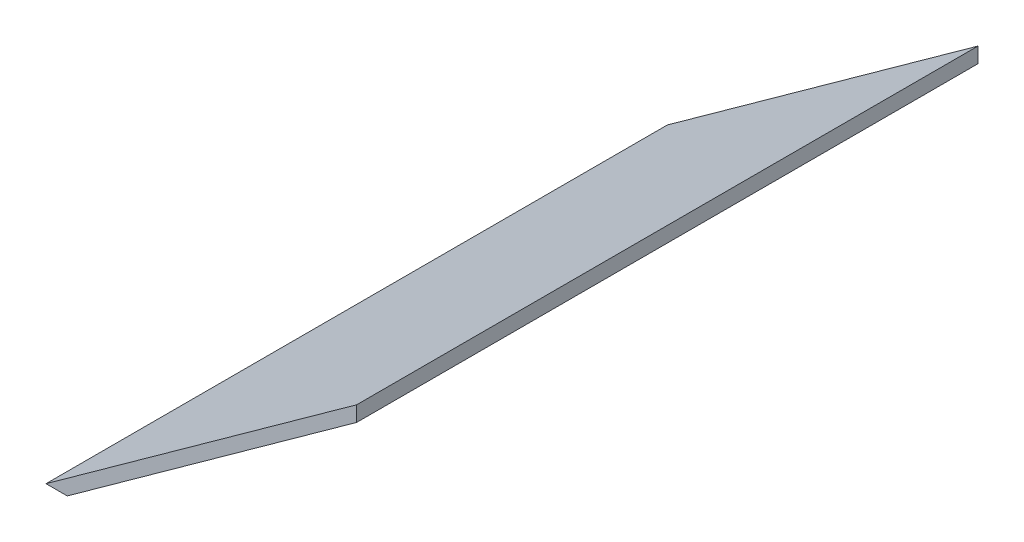
ISO-10303-21;
HEADER;
FILE_DESCRIPTION(('STEP AP214'),'2;1');
FILE_NAME('part.step','',(''),(''),'','','');
FILE_SCHEMA(('AUTOMOTIVE_DESIGN { 1 0 10303 214 1 1 1 1 }'));
ENDSEC;
DATA;
#1=APPLICATION_CONTEXT('core data for automotive mechanical design processes');
#2=APPLICATION_PROTOCOL_DEFINITION('international standard','automotive_design',2000,#1);
#3=PRODUCT_CONTEXT('',#1,'mechanical');
#4=PRODUCT('Part','Part','',(#3));
#5=PRODUCT_RELATED_PRODUCT_CATEGORY('part','',(#4));
#6=PRODUCT_DEFINITION_FORMATION('','',#4);
#7=PRODUCT_DEFINITION_CONTEXT('part definition',#1,'design');
#8=PRODUCT_DEFINITION('design','',#6,#7);
#9=PRODUCT_DEFINITION_SHAPE('','',#8);
#10=(LENGTH_UNIT() NAMED_UNIT(*) SI_UNIT(.MILLI.,.METRE.));
#11=(NAMED_UNIT(*) PLANE_ANGLE_UNIT() SI_UNIT($,.RADIAN.));
#12=(NAMED_UNIT(*) SI_UNIT($,.STERADIAN.) SOLID_ANGLE_UNIT());
#13=UNCERTAINTY_MEASURE_WITH_UNIT(LENGTH_MEASURE(1.E-05),#10,'distance_accuracy_value','');
#14=(GEOMETRIC_REPRESENTATION_CONTEXT(3) GLOBAL_UNCERTAINTY_ASSIGNED_CONTEXT((#13)) GLOBAL_UNIT_ASSIGNED_CONTEXT((#10,
#11,#12)) REPRESENTATION_CONTEXT('',''));
#15=CARTESIAN_POINT('',(0.,0.,0.));
#16=DIRECTION('',(0.,0.,1.));
#17=DIRECTION('',(1.,0.,0.));
#18=AXIS2_PLACEMENT_3D('',#15,#16,#17);
#19=CARTESIAN_POINT('',(-107.885642443612,0.,500.));
#20=DIRECTION('',(0.,1.,0.));
#21=DIRECTION('',(0.,0.,1.));
#22=AXIS2_PLACEMENT_3D('',#19,#20,#21);
#23=PLANE('',#22);
#24=DIRECTION('',(1.,0.,0.));
#25=VECTOR('',#24,1.);
#26=CARTESIAN_POINT('',(-107.885642443612,0.,0.));
#27=LINE('',#26,#25);
#28=CARTESIAN_POINT('',(-125.,0.,0.));
#29=VERTEX_POINT('',#28);
#30=CARTESIAN_POINT('',(-107.885642443612,0.,0.));
#31=VERTEX_POINT('',#30);
#32=EDGE_CURVE('E97',#29,#31,#27,.T.);
#33=ORIENTED_EDGE('',*,*,#32,.T.);
#34=DIRECTION('',(0.,0.,-1.));
#35=VECTOR('',#34,1.);
#36=CARTESIAN_POINT('',(-107.885642443612,0.,500.));
#37=LINE('',#36,#35);
#38=CARTESIAN_POINT('',(-107.885642443612,0.,500.));
#39=VERTEX_POINT('',#38);
#40=EDGE_CURVE('E11',#39,#31,#37,.T.);
#41=ORIENTED_EDGE('',*,*,#40,.F.);
#42=DIRECTION('',(1.,0.,0.));
#43=VECTOR('',#42,1.);
#44=CARTESIAN_POINT('',(-107.885642443612,0.,500.));
#45=LINE('',#44,#43);
#46=CARTESIAN_POINT('',(-125.,0.,500.));
#47=VERTEX_POINT('',#46);
#48=EDGE_CURVE('E85',#47,#39,#45,.T.);
#49=ORIENTED_EDGE('',*,*,#48,.F.);
#50=DIRECTION('',(0.,0.,-1.));
#51=VECTOR('',#50,1.);
#52=CARTESIAN_POINT('',(-125.,0.,500.));
#53=LINE('',#52,#51);
#54=EDGE_CURVE('E93',#47,#29,#53,.T.);
#55=ORIENTED_EDGE('',*,*,#54,.T.);
#56=EDGE_LOOP('',(#33,#41,#49,#55));
#57=FACE_BOUND('',#56,.T.);
#58=ADVANCED_FACE('F34',(#57),#23,.F.);
#59=CARTESIAN_POINT('',(5.84304725845077,81.884656585485,500.));
#60=DIRECTION('',(-0.584304725845076,0.811534341451495,0.));
#61=DIRECTION('',(-0.811534341451494,-0.584304725845076,0.));
#62=AXIS2_PLACEMENT_3D('',#59,#60,#61);
#63=PLANE('',#62);
#64=DIRECTION('',(0.811534341451494,0.584304725845076,0.));
#65=VECTOR('',#64,1.);
#66=CARTESIAN_POINT('',(5.84304725845077,81.884656585485,0.));
#67=LINE('',#66,#65);
#68=CARTESIAN_POINT('',(125.,167.6776625594,0.));
#69=VERTEX_POINT('',#68);
#70=EDGE_CURVE('E89',#31,#69,#67,.T.);
#71=ORIENTED_EDGE('',*,*,#70,.T.);
#72=DIRECTION('',(0.,0.,-1.));
#73=VECTOR('',#72,1.);
#74=CARTESIAN_POINT('',(125.,167.6776625594,500.));
#75=LINE('',#74,#73);
#76=CARTESIAN_POINT('',(125.,167.6776625594,500.));
#77=VERTEX_POINT('',#76);
#78=EDGE_CURVE('E42',#77,#69,#75,.T.);
#79=ORIENTED_EDGE('',*,*,#78,.F.);
#80=DIRECTION('',(0.811534341451495,0.584304725845076,0.));
#81=VECTOR('',#80,1.);
#82=CARTESIAN_POINT('',(5.84304725845077,81.884656585485,500.));
#83=LINE('',#82,#81);
#84=EDGE_CURVE('E80',#39,#77,#83,.T.);
#85=ORIENTED_EDGE('',*,*,#84,.F.);
#86=ORIENTED_EDGE('',*,*,#40,.T.);
#87=EDGE_LOOP('',(#71,#79,#85,#86));
#88=FACE_BOUND('',#87,.T.);
#89=ADVANCED_FACE('F88',(#88),#63,.F.);
#90=CARTESIAN_POINT('',(125.,167.6776625594,500.));
#91=DIRECTION('',(-1.,0.,0.));
#92=DIRECTION('',(0.,0.,1.));
#93=AXIS2_PLACEMENT_3D('',#90,#91,#92);
#94=PLANE('',#93);
#95=DIRECTION('',(0.,1.,0.));
#96=VECTOR('',#95,1.);
#97=CARTESIAN_POINT('',(125.,167.6776625594,0.));
#98=LINE('',#97,#96);
#99=CARTESIAN_POINT('',(125.,180.,0.));
#100=VERTEX_POINT('',#99);
#101=EDGE_CURVE('E67',#69,#100,#98,.T.);
#102=ORIENTED_EDGE('',*,*,#101,.T.);
#103=DIRECTION('',(0.,0.,-1.));
#104=VECTOR('',#103,1.);
#105=CARTESIAN_POINT('',(125.,180.,500.));
#106=LINE('',#105,#104);
#107=CARTESIAN_POINT('',(125.,180.,500.));
#108=VERTEX_POINT('',#107);
#109=EDGE_CURVE('E90',#108,#100,#106,.T.);
#110=ORIENTED_EDGE('',*,*,#109,.F.);
#111=DIRECTION('',(0.,1.,0.));
#112=VECTOR('',#111,1.);
#113=CARTESIAN_POINT('',(125.,167.6776625594,500.));
#114=LINE('',#113,#112);
#115=EDGE_CURVE('E83',#77,#108,#114,.T.);
#116=ORIENTED_EDGE('',*,*,#115,.F.);
#117=ORIENTED_EDGE('',*,*,#78,.T.);
#118=EDGE_LOOP('',(#102,#110,#116,#117));
#119=FACE_BOUND('',#118,.T.);
#120=ADVANCED_FACE('F91',(#119),#94,.F.);
#121=CARTESIAN_POINT('',(-125.,0.,500.));
#122=DIRECTION('',(0.584304725845076,-0.811534341451494,0.));
#123=DIRECTION('',(0.811534341451494,0.584304725845076,0.));
#124=AXIS2_PLACEMENT_3D('',#121,#122,#123);
#125=PLANE('',#124);
#126=DIRECTION('',(-0.811534341451494,-0.584304725845076,0.));
#127=VECTOR('',#126,1.);
#128=CARTESIAN_POINT('',(-125.,0.,0.));
#129=LINE('',#128,#127);
#130=EDGE_CURVE('E73',#100,#29,#129,.T.);
#131=ORIENTED_EDGE('',*,*,#130,.T.);
#132=ORIENTED_EDGE('',*,*,#54,.F.);
#133=DIRECTION('',(-0.811534341451494,-0.584304725845076,0.));
#134=VECTOR('',#133,1.);
#135=CARTESIAN_POINT('',(-125.,0.,500.));
#136=LINE('',#135,#134);
#137=EDGE_CURVE('E50',#108,#47,#136,.T.);
#138=ORIENTED_EDGE('',*,*,#137,.F.);
#139=ORIENTED_EDGE('',*,*,#109,.T.);
#140=EDGE_LOOP('',(#131,#132,#138,#139));
#141=FACE_BOUND('',#140,.T.);
#142=ADVANCED_FACE('F104',(#141),#125,.F.);
#143=CARTESIAN_POINT('',(0.,0.,500.));
#144=DIRECTION('',(0.,0.,-1.));
#145=DIRECTION('',(-1.,0.,0.));
#146=AXIS2_PLACEMENT_3D('',#143,#144,#145);
#147=PLANE('',#146);
#148=ORIENTED_EDGE('',*,*,#48,.T.);
#149=ORIENTED_EDGE('',*,*,#84,.T.);
#150=ORIENTED_EDGE('',*,*,#115,.T.);
#151=ORIENTED_EDGE('',*,*,#137,.T.);
#152=EDGE_LOOP('',(#148,#149,#150,#151));
#153=FACE_BOUND('',#152,.T.);
#154=ADVANCED_FACE('F81',(#153),#147,.F.);
#155=CARTESIAN_POINT('',(0.,0.,0.));
#156=DIRECTION('',(0.,0.,-1.));
#157=DIRECTION('',(-1.,0.,0.));
#158=AXIS2_PLACEMENT_3D('',#155,#156,#157);
#159=PLANE('',#158);
#160=ORIENTED_EDGE('',*,*,#32,.F.);
#161=ORIENTED_EDGE('',*,*,#130,.F.);
#162=ORIENTED_EDGE('',*,*,#101,.F.);
#163=ORIENTED_EDGE('',*,*,#70,.F.);
#164=EDGE_LOOP('',(#160,#161,#162,#163));
#165=FACE_BOUND('',#164,.T.);
#166=ADVANCED_FACE('F107',(#165),#159,.T.);
#167=CLOSED_SHELL('',(#58,#89,#120,#142,#154,#166));
#168=MANIFOLD_SOLID_BREP('B2',#167);
#169=ADVANCED_BREP_SHAPE_REPRESENTATION('',(#18,#168),#14);
#170=SHAPE_DEFINITION_REPRESENTATION(#9,#169);
ENDSEC;
END-ISO-10303-21;
